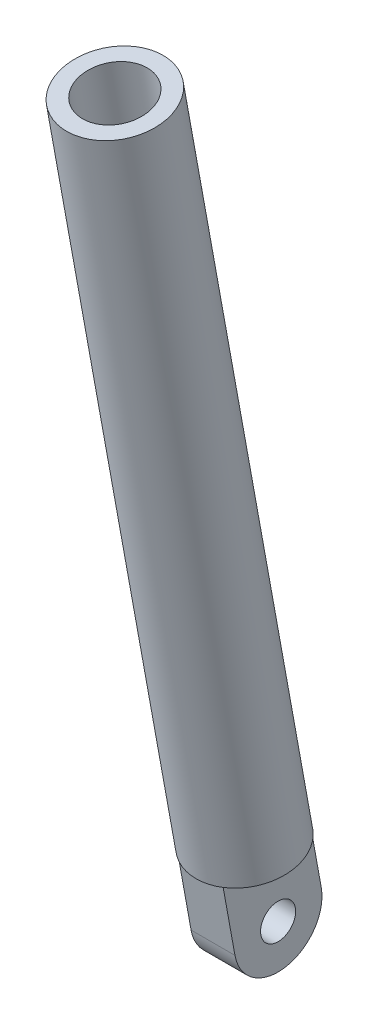
ISO-10303-21;
HEADER;
FILE_DESCRIPTION(('STEP AP214'),'2;1');
FILE_NAME('part.step','',(''),(''),'','','');
FILE_SCHEMA(('AUTOMOTIVE_DESIGN { 1 0 10303 214 1 1 1 1 }'));
ENDSEC;
DATA;
#1=APPLICATION_CONTEXT('core data for automotive mechanical design processes');
#2=APPLICATION_PROTOCOL_DEFINITION('international standard','automotive_design',2000,#1);
#3=PRODUCT_CONTEXT('',#1,'mechanical');
#4=PRODUCT('Part','Part','',(#3));
#5=PRODUCT_RELATED_PRODUCT_CATEGORY('part','',(#4));
#6=PRODUCT_DEFINITION_FORMATION('','',#4);
#7=PRODUCT_DEFINITION_CONTEXT('part definition',#1,'design');
#8=PRODUCT_DEFINITION('design','',#6,#7);
#9=PRODUCT_DEFINITION_SHAPE('','',#8);
#10=(LENGTH_UNIT() NAMED_UNIT(*) SI_UNIT(.MILLI.,.METRE.));
#11=(NAMED_UNIT(*) PLANE_ANGLE_UNIT() SI_UNIT($,.RADIAN.));
#12=(NAMED_UNIT(*) SI_UNIT($,.STERADIAN.) SOLID_ANGLE_UNIT());
#13=UNCERTAINTY_MEASURE_WITH_UNIT(LENGTH_MEASURE(1.E-05),#10,'distance_accuracy_value','');
#14=(GEOMETRIC_REPRESENTATION_CONTEXT(3) GLOBAL_UNCERTAINTY_ASSIGNED_CONTEXT((#13)) GLOBAL_UNIT_ASSIGNED_CONTEXT((#10,
#11,#12)) REPRESENTATION_CONTEXT('',''));
#15=CARTESIAN_POINT('',(0.,0.,0.));
#16=DIRECTION('',(0.,0.,1.));
#17=DIRECTION('',(1.,0.,0.));
#18=AXIS2_PLACEMENT_3D('',#15,#16,#17);
#19=CARTESIAN_POINT('',(2450.0000000001,-478.633122855309,65.2704072888011));
#20=DIRECTION('',(0.,-0.983852787309741,-0.178979587950285));
#21=DIRECTION('',(-1.,0.,0.));
#22=AXIS2_PLACEMENT_3D('',#19,#20,#21);
#23=PLANE('',#22);
#24=CARTESIAN_POINT('',(2450.0000000001,-478.633122855309,65.2704072888011));
#25=DIRECTION('',(0.,0.983852787309741,0.178979587950285));
#26=DIRECTION('',(1.,0.,0.));
#27=AXIS2_PLACEMENT_3D('',#24,#25,#26);
#28=CIRCLE('',#27,74.9999999999999);
#29=CARTESIAN_POINT('',(2525.0000000001,-478.633122855309,65.2704072888011));
#30=VERTEX_POINT('',#29);
#31=EDGE_CURVE('E19',#30,#30,#28,.T.);
#32=ORIENTED_EDGE('',*,*,#31,.T.);
#33=EDGE_LOOP('',(#32));
#34=FACE_BOUND('',#33,.T.);
#35=ADVANCED_FACE('F16',(#34),#23,.F.);
#36=CARTESIAN_POINT('',(2400.00000000005,-700.000000000001,24.9999999999868));
#37=DIRECTION('',(-1.,0.,0.));
#38=DIRECTION('',(0.,0.983852787309741,0.178979587950285));
#39=AXIS2_PLACEMENT_3D('',#36,#37,#38);
#40=CYLINDRICAL_SURFACE('',#39,40.);
#41=CARTESIAN_POINT('',(2400.00000000005,-700.000000000001,24.9999999999868));
#42=DIRECTION('',(-1.,0.,0.));
#43=DIRECTION('',(0.,0.983852787309741,0.178979587950285));
#44=AXIS2_PLACEMENT_3D('',#41,#42,#43);
#45=CIRCLE('',#44,40.);
#46=CARTESIAN_POINT('',(2400.00000000005,-660.645888507611,32.1591835179982));
#47=VERTEX_POINT('',#46);
#48=EDGE_CURVE('E71',#47,#47,#45,.F.);
#49=ORIENTED_EDGE('',*,*,#48,.F.);
#50=EDGE_LOOP('',(#49));
#51=FACE_BOUND('',#50,.T.);
#52=CARTESIAN_POINT('',(2500.00000000005,-700.000000000001,24.9999999999868));
#53=DIRECTION('',(-1.,0.,0.));
#54=DIRECTION('',(0.,0.983852787309741,0.178979587950285));
#55=AXIS2_PLACEMENT_3D('',#52,#53,#54);
#56=CIRCLE('',#55,40.);
#57=CARTESIAN_POINT('',(2500.00000000005,-660.645888507611,32.1591835179982));
#58=VERTEX_POINT('',#57);
#59=EDGE_CURVE('E65',#58,#58,#56,.T.);
#60=ORIENTED_EDGE('',*,*,#59,.F.);
#61=EDGE_LOOP('',(#60));
#62=FACE_BOUND('',#61,.T.);
#63=ADVANCED_FACE('F231',(#51,#62),#40,.F.);
#64=CARTESIAN_POINT('',(2500.00000000005,-700.000000000001,24.9999999999868));
#65=DIRECTION('',(-1.,0.,0.));
#66=DIRECTION('',(0.,0.983852787309741,0.178979587950285));
#67=AXIS2_PLACEMENT_3D('',#64,#65,#66);
#68=CYLINDRICAL_SURFACE('',#67,100.000000000001);
#69=CARTESIAN_POINT('',(2400.00000000005,-700.000000000001,24.9999999999868));
#70=DIRECTION('',(-1.,0.,0.));
#71=DIRECTION('',(0.,0.983852787309741,0.178979587950285));
#72=AXIS2_PLACEMENT_3D('',#69,#70,#71);
#73=CIRCLE('',#72,100.000000000001);
#74=CARTESIAN_POINT('',(2400.00000000005,-682.102041204972,-73.3852787309877));
#75=VERTEX_POINT('',#74);
#76=CARTESIAN_POINT('',(2400.00000000005,-717.897958795037,123.38527873096));
#77=VERTEX_POINT('',#76);
#78=EDGE_CURVE('E70',#75,#77,#73,.T.);
#79=ORIENTED_EDGE('',*,*,#78,.F.);
#80=DIRECTION('',(1.,0.,-2.4008283376329E-13));
#81=VECTOR('',#80,1.);
#82=CARTESIAN_POINT('',(2400.00000000005,-682.102041204971,-73.3852787309877));
#83=LINE('',#82,#81);
#84=CARTESIAN_POINT('',(2500.0000000001,-682.102041204967,-73.3852787310116));
#85=VERTEX_POINT('',#84);
#86=EDGE_CURVE('E67',#75,#85,#83,.T.);
#87=ORIENTED_EDGE('',*,*,#86,.T.);
#88=CARTESIAN_POINT('',(2500.0000000001,-700.000000000001,24.9999999999868));
#89=DIRECTION('',(-1.,0.,0.));
#90=DIRECTION('',(0.,0.983852787309741,0.178979587950285));
#91=AXIS2_PLACEMENT_3D('',#88,#89,#90);
#92=CIRCLE('',#91,100.000000000001);
#93=CARTESIAN_POINT('',(2500.00000000008,-717.897958795041,123.385278730984));
#94=VERTEX_POINT('',#93);
#95=EDGE_CURVE('E54',#94,#85,#92,.F.);
#96=ORIENTED_EDGE('',*,*,#95,.F.);
#97=DIRECTION('',(-1.,0.,-2.40527413854151E-13));
#98=VECTOR('',#97,1.);
#99=CARTESIAN_POINT('',(2500.0000000001,-717.897958795048,123.385278730983));
#100=LINE('',#99,#98);
#101=EDGE_CURVE('E83',#94,#77,#100,.T.);
#102=ORIENTED_EDGE('',*,*,#101,.T.);
#103=EDGE_LOOP('',(#79,#87,#96,#102));
#104=FACE_BOUND('',#103,.T.);
#105=ADVANCED_FACE('F68',(#104),#68,.T.);
#106=CARTESIAN_POINT('',(2500.0000000001,-570.320040698587,150.232216923525));
#107=DIRECTION('',(2.444106377611E-13,0.178979587950285,-0.983852787309741));
#108=DIRECTION('',(-1.,0.,-2.40527413854151E-13));
#109=AXIS2_PLACEMENT_3D('',#106,#107,#108);
#110=PLANE('',#109);
#111=DIRECTION('',(0.,-0.983852787309741,-0.178979587950285));
#112=VECTOR('',#111,1.);
#113=CARTESIAN_POINT('',(2500.00000000005,-717.897958795033,123.385278730986));
#114=LINE('',#113,#112);
#115=CARTESIAN_POINT('',(2500.00000000008,-570.32004069858,150.232216923527));
#116=VERTEX_POINT('',#115);
#117=EDGE_CURVE('E64',#116,#94,#114,.T.);
#118=ORIENTED_EDGE('',*,*,#117,.F.);
#119=DIRECTION('',(1.,0.,0.));
#120=VECTOR('',#119,1.);
#121=CARTESIAN_POINT('',(2450.0000000001,-570.320040698573,150.232216923528));
#122=LINE('',#121,#120);
#123=CARTESIAN_POINT('',(2400.00000000008,-570.32004069857,150.232216923516));
#124=VERTEX_POINT('',#123);
#125=EDGE_CURVE('E101',#116,#124,#122,.F.);
#126=ORIENTED_EDGE('',*,*,#125,.T.);
#127=DIRECTION('',(0.,0.983852787309741,0.178979587950285));
#128=VECTOR('',#127,1.);
#129=CARTESIAN_POINT('',(2400.00000000005,-717.897958795029,123.385278730962));
#130=LINE('',#129,#128);
#131=EDGE_CURVE('E80',#77,#124,#130,.T.);
#132=ORIENTED_EDGE('',*,*,#131,.F.);
#133=ORIENTED_EDGE('',*,*,#101,.F.);
#134=EDGE_LOOP('',(#118,#126,#132,#133));
#135=FACE_BOUND('',#134,.T.);
#136=ADVANCED_FACE('F112',(#135),#110,.F.);
#137=CARTESIAN_POINT('',(2450.0000000001,1070.93501715753,347.1632583105));
#138=DIRECTION('',(0.,0.983852787309741,0.178979587950285));
#139=DIRECTION('',(1.,0.,0.));
#140=AXIS2_PLACEMENT_3D('',#137,#138,#139);
#141=CYLINDRICAL_SURFACE('',#140,74.9999999999999);
#142=CARTESIAN_POINT('',(2450.0000000001,1070.93501715753,347.1632583105));
#143=DIRECTION('',(0.,0.983852787309741,0.178979587950285));
#144=DIRECTION('',(1.,0.,0.));
#145=AXIS2_PLACEMENT_3D('',#142,#143,#144);
#146=CIRCLE('',#145,74.9999999999999);
#147=CARTESIAN_POINT('',(2525.0000000001,1070.93501715753,347.1632583105));
#148=VERTEX_POINT('',#147);
#149=EDGE_CURVE('E97',#148,#148,#146,.F.);
#150=ORIENTED_EDGE('',*,*,#149,.F.);
#151=EDGE_LOOP('',(#150));
#152=FACE_BOUND('',#151,.T.);
#153=ORIENTED_EDGE('',*,*,#31,.F.);
#154=EDGE_LOOP('',(#153));
#155=FACE_BOUND('',#154,.T.);
#156=ADVANCED_FACE('F110',(#152,#155),#141,.F.);
#157=CARTESIAN_POINT('',(2500.00000000005,-682.102041204971,-73.3852787309877));
#158=DIRECTION('',(1.,0.,0.));
#159=DIRECTION('',(0.,-0.983852787309741,-0.178979587950285));
#160=AXIS2_PLACEMENT_3D('',#157,#158,#159);
#161=PLANE('',#160);
#162=DIRECTION('',(0.,0.178979587950285,-0.983852787309741));
#163=VECTOR('',#162,1.);
#164=CARTESIAN_POINT('',(2500.0000000001,-552.42208190354,51.8469381925295));
#165=LINE('',#164,#163);
#166=CARTESIAN_POINT('',(2500.00000000013,-534.524123108517,-46.5383405384581));
#167=VERTEX_POINT('',#166);
#168=EDGE_CURVE('E100',#167,#116,#165,.F.);
#169=ORIENTED_EDGE('',*,*,#168,.T.);
#170=ORIENTED_EDGE('',*,*,#117,.T.);
#171=ORIENTED_EDGE('',*,*,#95,.T.);
#172=DIRECTION('',(0.,0.983852787309741,0.178979587950285));
#173=VECTOR('',#172,1.);
#174=CARTESIAN_POINT('',(2500.0000000001,-534.524123108521,-46.5383405384718));
#175=LINE('',#174,#173);
#176=EDGE_CURVE('E62',#85,#167,#175,.T.);
#177=ORIENTED_EDGE('',*,*,#176,.T.);
#178=EDGE_LOOP('',(#169,#170,#171,#177));
#179=FACE_BOUND('',#178,.T.);
#180=ORIENTED_EDGE('',*,*,#59,.T.);
#181=EDGE_LOOP('',(#180));
#182=FACE_BOUND('',#181,.T.);
#183=ADVANCED_FACE('F59',(#179,#182),#161,.T.);
#184=CARTESIAN_POINT('',(2400.00000000005,-534.524123108526,-46.5383405384479));
#185=DIRECTION('',(2.44087493073725E-13,-0.178979587950285,0.983852787309741));
#186=DIRECTION('',(1.,0.,-2.4008283376329E-13));
#187=AXIS2_PLACEMENT_3D('',#184,#185,#186);
#188=PLANE('',#187);
#189=DIRECTION('',(0.,0.983852787309741,0.178979587950285));
#190=VECTOR('',#189,1.);
#191=CARTESIAN_POINT('',(2400.00000000005,-682.102041204972,-73.3852787309879));
#192=LINE('',#191,#190);
#193=CARTESIAN_POINT('',(2400.00000000005,-534.524123108519,-46.5383405384465));
#194=VERTEX_POINT('',#193);
#195=EDGE_CURVE('E34',#194,#75,#192,.F.);
#196=ORIENTED_EDGE('',*,*,#195,.F.);
#197=DIRECTION('',(1.,0.,0.));
#198=VECTOR('',#197,1.);
#199=CARTESIAN_POINT('',(2450.0000000001,-534.524123108511,-46.5383405384452));
#200=LINE('',#199,#198);
#201=EDGE_CURVE('E75',#194,#167,#200,.T.);
#202=ORIENTED_EDGE('',*,*,#201,.T.);
#203=ORIENTED_EDGE('',*,*,#176,.F.);
#204=ORIENTED_EDGE('',*,*,#86,.F.);
#205=EDGE_LOOP('',(#196,#202,#203,#204));
#206=FACE_BOUND('',#205,.T.);
#207=ADVANCED_FACE('F73',(#206),#188,.F.);
#208=CARTESIAN_POINT('',(2400.00000000005,-700.000000000001,24.9999999999864));
#209=DIRECTION('',(-1.,0.,0.));
#210=DIRECTION('',(0.,0.983852787309741,0.178979587950285));
#211=AXIS2_PLACEMENT_3D('',#208,#209,#210);
#212=PLANE('',#211);
#213=DIRECTION('',(0.,0.178979587950285,-0.983852787309741));
#214=VECTOR('',#213,1.);
#215=CARTESIAN_POINT('',(2400.00000000005,-552.42208190354,51.8469381925295));
#216=LINE('',#215,#214);
#217=EDGE_CURVE('E96',#124,#194,#216,.T.);
#218=ORIENTED_EDGE('',*,*,#217,.T.);
#219=ORIENTED_EDGE('',*,*,#195,.T.);
#220=ORIENTED_EDGE('',*,*,#78,.T.);
#221=ORIENTED_EDGE('',*,*,#131,.T.);
#222=EDGE_LOOP('',(#218,#219,#220,#221));
#223=FACE_BOUND('',#222,.T.);
#224=ORIENTED_EDGE('',*,*,#48,.T.);
#225=EDGE_LOOP('',(#224));
#226=FACE_BOUND('',#225,.T.);
#227=ADVANCED_FACE('F151',(#223,#226),#212,.T.);
#228=CARTESIAN_POINT('',(2450.0000000001,-552.42208190354,51.8469381925295));
#229=DIRECTION('',(0.,0.983852787309741,0.178979587950285));
#230=DIRECTION('',(1.,0.,0.));
#231=AXIS2_PLACEMENT_3D('',#228,#229,#230);
#232=PLANE('',#231);
#233=ORIENTED_EDGE('',*,*,#125,.F.);
#234=CARTESIAN_POINT('',(2450.0000000001,-552.42208190354,51.8469381925295));
#235=DIRECTION('',(0.,-0.983852787309741,-0.178979587950285));
#236=DIRECTION('',(-1.,0.,0.));
#237=AXIS2_PLACEMENT_3D('',#234,#235,#236);
#238=CIRCLE('',#237,111.803398875012);
#239=EDGE_CURVE('E93',#124,#116,#238,.F.);
#240=ORIENTED_EDGE('',*,*,#239,.F.);
#241=EDGE_LOOP('',(#233,#240));
#242=FACE_BOUND('',#241,.T.);
#243=ADVANCED_FACE('F147',(#242),#232,.F.);
#244=CARTESIAN_POINT('',(2450.0000000001,1070.93501715753,347.1632583105));
#245=DIRECTION('',(0.,0.983852787309741,0.178979587950285));
#246=DIRECTION('',(1.,0.,0.));
#247=AXIS2_PLACEMENT_3D('',#244,#245,#246);
#248=PLANE('',#247);
#249=CARTESIAN_POINT('',(2450.0000000001,1070.93501715753,347.1632583105));
#250=DIRECTION('',(0.,-0.983852787309741,-0.178979587950285));
#251=DIRECTION('',(-1.,0.,0.));
#252=AXIS2_PLACEMENT_3D('',#249,#250,#251);
#253=CIRCLE('',#252,111.803398875012);
#254=CARTESIAN_POINT('',(2338.19660112509,1070.93501715753,347.1632583105));
#255=VERTEX_POINT('',#254);
#256=EDGE_CURVE('E90',#255,#255,#253,.T.);
#257=ORIENTED_EDGE('',*,*,#256,.F.);
#258=EDGE_LOOP('',(#257));
#259=FACE_BOUND('',#258,.T.);
#260=ORIENTED_EDGE('',*,*,#149,.T.);
#261=EDGE_LOOP('',(#260));
#262=FACE_BOUND('',#261,.T.);
#263=ADVANCED_FACE('F143',(#259,#262),#248,.T.);
#264=CARTESIAN_POINT('',(2450.0000000001,-552.42208190354,51.8469381925295));
#265=DIRECTION('',(0.,0.983852787309741,0.178979587950285));
#266=DIRECTION('',(1.,0.,0.));
#267=AXIS2_PLACEMENT_3D('',#264,#265,#266);
#268=PLANE('',#267);
#269=CARTESIAN_POINT('',(2450.0000000001,-552.42208190354,51.8469381925295));
#270=DIRECTION('',(0.,-0.983852787309741,-0.178979587950285));
#271=DIRECTION('',(-1.,0.,0.));
#272=AXIS2_PLACEMENT_3D('',#269,#270,#271);
#273=CIRCLE('',#272,111.803398875012);
#274=EDGE_CURVE('E87',#116,#167,#273,.F.);
#275=ORIENTED_EDGE('',*,*,#274,.F.);
#276=ORIENTED_EDGE('',*,*,#168,.F.);
#277=EDGE_LOOP('',(#275,#276));
#278=FACE_BOUND('',#277,.T.);
#279=ADVANCED_FACE('F139',(#278),#268,.F.);
#280=CARTESIAN_POINT('',(2450.0000000001,-552.42208190354,51.8469381925295));
#281=DIRECTION('',(0.,0.983852787309741,0.178979587950285));
#282=DIRECTION('',(1.,0.,0.));
#283=AXIS2_PLACEMENT_3D('',#280,#281,#282);
#284=PLANE('',#283);
#285=ORIENTED_EDGE('',*,*,#201,.F.);
#286=CARTESIAN_POINT('',(2450.0000000001,-552.422081903555,51.8469381925268));
#287=DIRECTION('',(0.,-0.983852787309741,-0.178979587950285));
#288=DIRECTION('',(-1.,0.,0.));
#289=AXIS2_PLACEMENT_3D('',#286,#287,#288);
#290=CIRCLE('',#289,111.803398875012);
#291=EDGE_CURVE('E25',#167,#194,#290,.F.);
#292=ORIENTED_EDGE('',*,*,#291,.F.);
#293=EDGE_LOOP('',(#285,#292));
#294=FACE_BOUND('',#293,.T.);
#295=ADVANCED_FACE('F132',(#294),#284,.F.);
#296=CARTESIAN_POINT('',(2450.0000000001,-552.42208190354,51.8469381925295));
#297=DIRECTION('',(0.,0.983852787309741,0.178979587950285));
#298=DIRECTION('',(1.,0.,0.));
#299=AXIS2_PLACEMENT_3D('',#296,#297,#298);
#300=PLANE('',#299);
#301=CARTESIAN_POINT('',(2450.0000000001,-552.422081903555,51.8469381925268));
#302=DIRECTION('',(0.,-0.983852787309741,-0.178979587950285));
#303=DIRECTION('',(-1.,0.,0.));
#304=AXIS2_PLACEMENT_3D('',#301,#302,#303);
#305=CIRCLE('',#304,111.803398875012);
#306=EDGE_CURVE('E10',#194,#124,#305,.F.);
#307=ORIENTED_EDGE('',*,*,#306,.F.);
#308=ORIENTED_EDGE('',*,*,#217,.F.);
#309=EDGE_LOOP('',(#307,#308));
#310=FACE_BOUND('',#309,.T.);
#311=ADVANCED_FACE('F126',(#310),#300,.F.);
#312=CARTESIAN_POINT('',(2450.0000000001,1070.93501715753,347.1632583105));
#313=DIRECTION('',(0.,-0.983852787309741,-0.178979587950285));
#314=DIRECTION('',(-1.,0.,0.));
#315=AXIS2_PLACEMENT_3D('',#312,#313,#314);
#316=CYLINDRICAL_SURFACE('',#315,111.803398875012);
#317=ORIENTED_EDGE('',*,*,#239,.T.);
#318=ORIENTED_EDGE('',*,*,#274,.T.);
#319=ORIENTED_EDGE('',*,*,#291,.T.);
#320=ORIENTED_EDGE('',*,*,#306,.T.);
#321=EDGE_LOOP('',(#317,#318,#319,#320));
#322=FACE_BOUND('',#321,.T.);
#323=ORIENTED_EDGE('',*,*,#256,.T.);
#324=EDGE_LOOP('',(#323));
#325=FACE_BOUND('',#324,.T.);
#326=ADVANCED_FACE('F124',(#322,#325),#316,.T.);
#327=CLOSED_SHELL('',(#35,#63,#105,#136,#156,#183,#207,#227,#243,#263,#279,#295,#311,#326));
#328=MANIFOLD_SOLID_BREP('B1',#327);
#329=ADVANCED_BREP_SHAPE_REPRESENTATION('',(#18,#328),#14);
#330=SHAPE_DEFINITION_REPRESENTATION(#9,#329);
ENDSEC;
END-ISO-10303-21;
